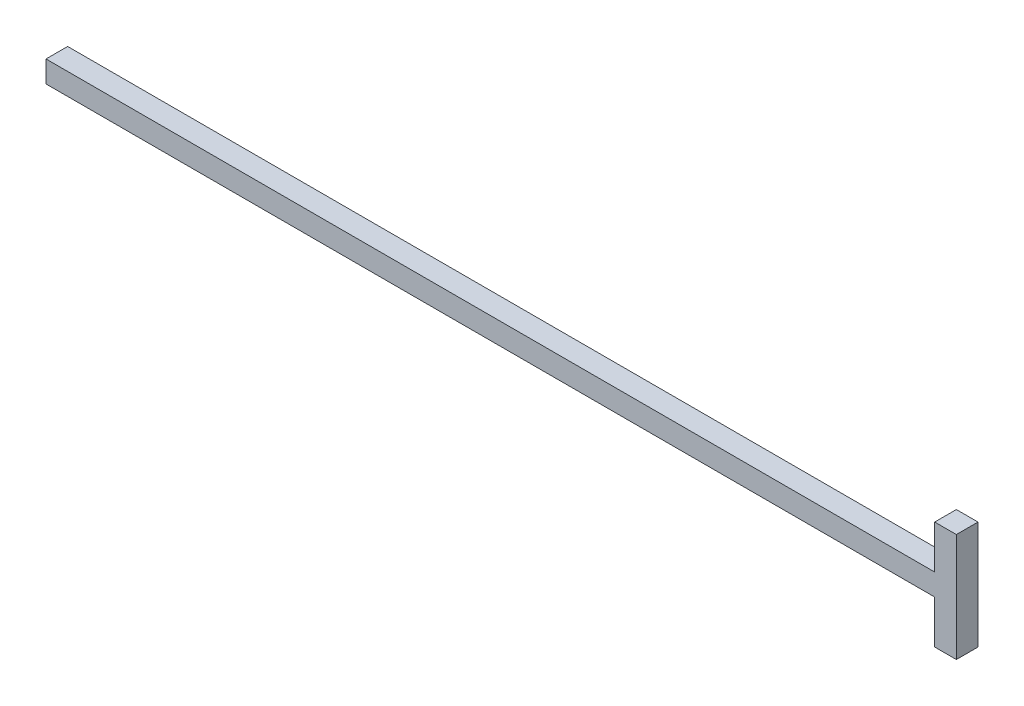
ISO-10303-21;
HEADER;
FILE_DESCRIPTION(('STEP AP214'),'2;1');
FILE_NAME('part.step','',(''),(''),'','','');
FILE_SCHEMA(('AUTOMOTIVE_DESIGN { 1 0 10303 214 1 1 1 1 }'));
ENDSEC;
DATA;
#1=APPLICATION_CONTEXT('core data for automotive mechanical design processes');
#2=APPLICATION_PROTOCOL_DEFINITION('international standard','automotive_design',2000,#1);
#3=PRODUCT_CONTEXT('',#1,'mechanical');
#4=PRODUCT('Part','Part','',(#3));
#5=PRODUCT_RELATED_PRODUCT_CATEGORY('part','',(#4));
#6=PRODUCT_DEFINITION_FORMATION('','',#4);
#7=PRODUCT_DEFINITION_CONTEXT('part definition',#1,'design');
#8=PRODUCT_DEFINITION('design','',#6,#7);
#9=PRODUCT_DEFINITION_SHAPE('','',#8);
#10=(LENGTH_UNIT() NAMED_UNIT(*) SI_UNIT(.MILLI.,.METRE.));
#11=(NAMED_UNIT(*) PLANE_ANGLE_UNIT() SI_UNIT($,.RADIAN.));
#12=(NAMED_UNIT(*) SI_UNIT($,.STERADIAN.) SOLID_ANGLE_UNIT());
#13=UNCERTAINTY_MEASURE_WITH_UNIT(LENGTH_MEASURE(1.E-05),#10,'distance_accuracy_value','');
#14=(GEOMETRIC_REPRESENTATION_CONTEXT(3) GLOBAL_UNCERTAINTY_ASSIGNED_CONTEXT((#13)) GLOBAL_UNIT_ASSIGNED_CONTEXT((#10,
#11,#12)) REPRESENTATION_CONTEXT('',''));
#15=CARTESIAN_POINT('',(0.,0.,0.));
#16=DIRECTION('',(0.,0.,1.));
#17=DIRECTION('',(1.,0.,0.));
#18=AXIS2_PLACEMENT_3D('',#15,#16,#17);
#19=CARTESIAN_POINT('',(133.477,0.,6.35));
#20=DIRECTION('',(1.,0.,0.));
#21=DIRECTION('',(0.,0.,-1.));
#22=AXIS2_PLACEMENT_3D('',#19,#20,#21);
#23=PLANE('',#22);
#24=DIRECTION('',(0.,-1.,0.));
#25=VECTOR('',#24,1.);
#26=CARTESIAN_POINT('',(133.477,0.,0.));
#27=LINE('',#26,#25);
#28=CARTESIAN_POINT('',(133.477,15.875,0.));
#29=VERTEX_POINT('',#28);
#30=CARTESIAN_POINT('',(133.477,-15.875,0.));
#31=VERTEX_POINT('',#30);
#32=EDGE_CURVE('E130',#29,#31,#27,.T.);
#33=ORIENTED_EDGE('',*,*,#32,.F.);
#34=DIRECTION('',(0.,0.,-1.));
#35=VECTOR('',#34,1.);
#36=CARTESIAN_POINT('',(133.477,15.875,6.35));
#37=LINE('',#36,#35);
#38=CARTESIAN_POINT('',(133.477,15.875,6.35));
#39=VERTEX_POINT('',#38);
#40=EDGE_CURVE('E11',#39,#29,#37,.T.);
#41=ORIENTED_EDGE('',*,*,#40,.F.);
#42=DIRECTION('',(0.,-1.,0.));
#43=VECTOR('',#42,1.);
#44=CARTESIAN_POINT('',(133.477,0.,6.35));
#45=LINE('',#44,#43);
#46=CARTESIAN_POINT('',(133.477,-15.875,6.35));
#47=VERTEX_POINT('',#46);
#48=EDGE_CURVE('E149',#39,#47,#45,.T.);
#49=ORIENTED_EDGE('',*,*,#48,.T.);
#50=DIRECTION('',(0.,0.,-1.));
#51=VECTOR('',#50,1.);
#52=CARTESIAN_POINT('',(133.477,-15.875,6.35));
#53=LINE('',#52,#51);
#54=EDGE_CURVE('E51',#47,#31,#53,.T.);
#55=ORIENTED_EDGE('',*,*,#54,.T.);
#56=EDGE_LOOP('',(#33,#41,#49,#55));
#57=FACE_BOUND('',#56,.T.);
#58=ADVANCED_FACE('F35',(#57),#23,.T.);
#59=CARTESIAN_POINT('',(0.,15.8750000000001,6.35));
#60=DIRECTION('',(0.,-1.,0.));
#61=DIRECTION('',(1.,0.,0.));
#62=AXIS2_PLACEMENT_3D('',#59,#60,#61);
#63=PLANE('',#62);
#64=DIRECTION('',(-1.,0.,0.));
#65=VECTOR('',#64,1.);
#66=CARTESIAN_POINT('',(0.,15.8750000000001,0.));
#67=LINE('',#66,#65);
#68=CARTESIAN_POINT('',(127.127,15.875,0.));
#69=VERTEX_POINT('',#68);
#70=EDGE_CURVE('E132',#29,#69,#67,.T.);
#71=ORIENTED_EDGE('',*,*,#70,.T.);
#72=DIRECTION('',(0.,0.,-1.));
#73=VECTOR('',#72,1.);
#74=CARTESIAN_POINT('',(127.127,15.875,6.35));
#75=LINE('',#74,#73);
#76=CARTESIAN_POINT('',(127.127,15.875,6.35));
#77=VERTEX_POINT('',#76);
#78=EDGE_CURVE('E43',#77,#69,#75,.T.);
#79=ORIENTED_EDGE('',*,*,#78,.F.);
#80=DIRECTION('',(-1.,0.,0.));
#81=VECTOR('',#80,1.);
#82=CARTESIAN_POINT('',(0.,15.8750000000001,6.35));
#83=LINE('',#82,#81);
#84=EDGE_CURVE('E174',#39,#77,#83,.T.);
#85=ORIENTED_EDGE('',*,*,#84,.F.);
#86=ORIENTED_EDGE('',*,*,#40,.T.);
#87=EDGE_LOOP('',(#71,#79,#85,#86));
#88=FACE_BOUND('',#87,.T.);
#89=ADVANCED_FACE('F165',(#88),#63,.F.);
#90=CARTESIAN_POINT('',(127.127,0.,6.35));
#91=DIRECTION('',(-1.,0.,0.));
#92=DIRECTION('',(0.,0.,1.));
#93=AXIS2_PLACEMENT_3D('',#90,#91,#92);
#94=PLANE('',#93);
#95=DIRECTION('',(0.,1.,0.));
#96=VECTOR('',#95,1.);
#97=CARTESIAN_POINT('',(127.127,0.,0.));
#98=LINE('',#97,#96);
#99=CARTESIAN_POINT('',(127.127,3.175,0.));
#100=VERTEX_POINT('',#99);
#101=EDGE_CURVE('E135',#100,#69,#98,.T.);
#102=ORIENTED_EDGE('',*,*,#101,.F.);
#103=DIRECTION('',(0.,0.,-1.));
#104=VECTOR('',#103,1.);
#105=CARTESIAN_POINT('',(127.127,3.175,6.35));
#106=LINE('',#105,#104);
#107=CARTESIAN_POINT('',(127.127,3.175,6.35));
#108=VERTEX_POINT('',#107);
#109=EDGE_CURVE('E155',#108,#100,#106,.T.);
#110=ORIENTED_EDGE('',*,*,#109,.F.);
#111=DIRECTION('',(0.,1.,0.));
#112=VECTOR('',#111,1.);
#113=CARTESIAN_POINT('',(127.127,0.,6.35));
#114=LINE('',#113,#112);
#115=EDGE_CURVE('E162',#108,#77,#114,.T.);
#116=ORIENTED_EDGE('',*,*,#115,.T.);
#117=ORIENTED_EDGE('',*,*,#78,.T.);
#118=EDGE_LOOP('',(#102,#110,#116,#117));
#119=FACE_BOUND('',#118,.T.);
#120=ADVANCED_FACE('F160',(#119),#94,.T.);
#121=CARTESIAN_POINT('',(0.,3.175,6.35));
#122=DIRECTION('',(0.,1.,0.));
#123=DIRECTION('',(0.,0.,1.));
#124=AXIS2_PLACEMENT_3D('',#121,#122,#123);
#125=PLANE('',#124);
#126=DIRECTION('',(1.,0.,0.));
#127=VECTOR('',#126,1.);
#128=CARTESIAN_POINT('',(0.,3.175,0.));
#129=LINE('',#128,#127);
#130=CARTESIAN_POINT('',(-133.477,3.175,0.));
#131=VERTEX_POINT('',#130);
#132=EDGE_CURVE('E138',#131,#100,#129,.T.);
#133=ORIENTED_EDGE('',*,*,#132,.F.);
#134=DIRECTION('',(0.,0.,-1.));
#135=VECTOR('',#134,1.);
#136=CARTESIAN_POINT('',(-133.477,3.175,6.35));
#137=LINE('',#136,#135);
#138=CARTESIAN_POINT('',(-133.477,3.175,6.35));
#139=VERTEX_POINT('',#138);
#140=EDGE_CURVE('E153',#139,#131,#137,.T.);
#141=ORIENTED_EDGE('',*,*,#140,.F.);
#142=DIRECTION('',(1.,0.,0.));
#143=VECTOR('',#142,1.);
#144=CARTESIAN_POINT('',(0.,3.175,6.35));
#145=LINE('',#144,#143);
#146=EDGE_CURVE('E173',#139,#108,#145,.T.);
#147=ORIENTED_EDGE('',*,*,#146,.T.);
#148=ORIENTED_EDGE('',*,*,#109,.T.);
#149=EDGE_LOOP('',(#133,#141,#147,#148));
#150=FACE_BOUND('',#149,.T.);
#151=ADVANCED_FACE('F171',(#150),#125,.T.);
#152=CARTESIAN_POINT('',(-133.477,0.,6.35));
#153=DIRECTION('',(1.,0.,0.));
#154=DIRECTION('',(0.,0.,-1.));
#155=AXIS2_PLACEMENT_3D('',#152,#153,#154);
#156=PLANE('',#155);
#157=DIRECTION('',(0.,-1.,0.));
#158=VECTOR('',#157,1.);
#159=CARTESIAN_POINT('',(-133.477,0.,0.));
#160=LINE('',#159,#158);
#161=CARTESIAN_POINT('',(-133.477,-3.175,0.));
#162=VERTEX_POINT('',#161);
#163=EDGE_CURVE('E141',#131,#162,#160,.T.);
#164=ORIENTED_EDGE('',*,*,#163,.T.);
#165=DIRECTION('',(0.,0.,-1.));
#166=VECTOR('',#165,1.);
#167=CARTESIAN_POINT('',(-133.477,-3.175,6.35));
#168=LINE('',#167,#166);
#169=CARTESIAN_POINT('',(-133.477,-3.175,6.35));
#170=VERTEX_POINT('',#169);
#171=EDGE_CURVE('E122',#170,#162,#168,.T.);
#172=ORIENTED_EDGE('',*,*,#171,.F.);
#173=DIRECTION('',(0.,-1.,0.));
#174=VECTOR('',#173,1.);
#175=CARTESIAN_POINT('',(-133.477,0.,6.35));
#176=LINE('',#175,#174);
#177=EDGE_CURVE('E110',#139,#170,#176,.T.);
#178=ORIENTED_EDGE('',*,*,#177,.F.);
#179=ORIENTED_EDGE('',*,*,#140,.T.);
#180=EDGE_LOOP('',(#164,#172,#178,#179));
#181=FACE_BOUND('',#180,.T.);
#182=ADVANCED_FACE('F200',(#181),#156,.F.);
#183=CARTESIAN_POINT('',(0.,-3.17499999999998,6.35));
#184=DIRECTION('',(0.,1.,0.));
#185=DIRECTION('',(-1.,0.,0.));
#186=AXIS2_PLACEMENT_3D('',#183,#184,#185);
#187=PLANE('',#186);
#188=DIRECTION('',(1.,0.,0.));
#189=VECTOR('',#188,1.);
#190=CARTESIAN_POINT('',(0.,-3.17499999999998,0.));
#191=LINE('',#190,#189);
#192=CARTESIAN_POINT('',(127.127,-3.17499999999995,0.));
#193=VERTEX_POINT('',#192);
#194=EDGE_CURVE('E119',#162,#193,#191,.T.);
#195=ORIENTED_EDGE('',*,*,#194,.T.);
#196=DIRECTION('',(0.,0.,-1.));
#197=VECTOR('',#196,1.);
#198=CARTESIAN_POINT('',(127.127,-3.17499999999995,6.35));
#199=LINE('',#198,#197);
#200=CARTESIAN_POINT('',(127.127,-3.17499999999995,6.35));
#201=VERTEX_POINT('',#200);
#202=EDGE_CURVE('E116',#201,#193,#199,.T.);
#203=ORIENTED_EDGE('',*,*,#202,.F.);
#204=DIRECTION('',(1.,0.,0.));
#205=VECTOR('',#204,1.);
#206=CARTESIAN_POINT('',(0.,-3.17499999999998,6.35));
#207=LINE('',#206,#205);
#208=EDGE_CURVE('E101',#170,#201,#207,.T.);
#209=ORIENTED_EDGE('',*,*,#208,.F.);
#210=ORIENTED_EDGE('',*,*,#171,.T.);
#211=EDGE_LOOP('',(#195,#203,#209,#210));
#212=FACE_BOUND('',#211,.T.);
#213=ADVANCED_FACE('F117',(#212),#187,.F.);
#214=CARTESIAN_POINT('',(127.127,0.,6.35));
#215=DIRECTION('',(1.,0.,0.));
#216=DIRECTION('',(0.,0.,-1.));
#217=AXIS2_PLACEMENT_3D('',#214,#215,#216);
#218=PLANE('',#217);
#219=DIRECTION('',(0.,-1.,0.));
#220=VECTOR('',#219,1.);
#221=CARTESIAN_POINT('',(127.127,0.,0.));
#222=LINE('',#221,#220);
#223=CARTESIAN_POINT('',(127.127,-15.875,0.));
#224=VERTEX_POINT('',#223);
#225=EDGE_CURVE('E144',#193,#224,#222,.T.);
#226=ORIENTED_EDGE('',*,*,#225,.T.);
#227=DIRECTION('',(0.,0.,-1.));
#228=VECTOR('',#227,1.);
#229=CARTESIAN_POINT('',(127.127,-15.875,6.35));
#230=LINE('',#229,#228);
#231=CARTESIAN_POINT('',(127.127,-15.875,6.35));
#232=VERTEX_POINT('',#231);
#233=EDGE_CURVE('E77',#232,#224,#230,.T.);
#234=ORIENTED_EDGE('',*,*,#233,.F.);
#235=DIRECTION('',(0.,-1.,0.));
#236=VECTOR('',#235,1.);
#237=CARTESIAN_POINT('',(127.127,0.,6.35));
#238=LINE('',#237,#236);
#239=EDGE_CURVE('E107',#201,#232,#238,.T.);
#240=ORIENTED_EDGE('',*,*,#239,.F.);
#241=ORIENTED_EDGE('',*,*,#202,.T.);
#242=EDGE_LOOP('',(#226,#234,#240,#241));
#243=FACE_BOUND('',#242,.T.);
#244=ADVANCED_FACE('F124',(#243),#218,.F.);
#245=CARTESIAN_POINT('',(0.,-15.875,6.35));
#246=DIRECTION('',(0.,-1.,0.));
#247=DIRECTION('',(0.,0.,-1.));
#248=AXIS2_PLACEMENT_3D('',#245,#246,#247);
#249=PLANE('',#248);
#250=DIRECTION('',(-1.,0.,0.));
#251=VECTOR('',#250,1.);
#252=CARTESIAN_POINT('',(0.,-15.875,0.));
#253=LINE('',#252,#251);
#254=EDGE_CURVE('E146',#31,#224,#253,.T.);
#255=ORIENTED_EDGE('',*,*,#254,.F.);
#256=ORIENTED_EDGE('',*,*,#54,.F.);
#257=DIRECTION('',(-1.,0.,0.));
#258=VECTOR('',#257,1.);
#259=CARTESIAN_POINT('',(0.,-15.875,6.35));
#260=LINE('',#259,#258);
#261=EDGE_CURVE('E125',#47,#232,#260,.T.);
#262=ORIENTED_EDGE('',*,*,#261,.T.);
#263=ORIENTED_EDGE('',*,*,#233,.T.);
#264=EDGE_LOOP('',(#255,#256,#262,#263));
#265=FACE_BOUND('',#264,.T.);
#266=ADVANCED_FACE('F179',(#265),#249,.T.);
#267=CARTESIAN_POINT('',(0.,0.,6.35));
#268=DIRECTION('',(0.,0.,1.));
#269=DIRECTION('',(1.,0.,0.));
#270=AXIS2_PLACEMENT_3D('',#267,#268,#269);
#271=PLANE('',#270);
#272=ORIENTED_EDGE('',*,*,#48,.F.);
#273=ORIENTED_EDGE('',*,*,#84,.T.);
#274=ORIENTED_EDGE('',*,*,#115,.F.);
#275=ORIENTED_EDGE('',*,*,#146,.F.);
#276=ORIENTED_EDGE('',*,*,#177,.T.);
#277=ORIENTED_EDGE('',*,*,#208,.T.);
#278=ORIENTED_EDGE('',*,*,#239,.T.);
#279=ORIENTED_EDGE('',*,*,#261,.F.);
#280=EDGE_LOOP('',(#272,#273,#274,#275,#276,#277,#278,#279));
#281=FACE_BOUND('',#280,.T.);
#282=ADVANCED_FACE('F104',(#281),#271,.T.);
#283=CARTESIAN_POINT('',(0.,0.,0.));
#284=DIRECTION('',(0.,0.,1.));
#285=DIRECTION('',(1.,0.,0.));
#286=AXIS2_PLACEMENT_3D('',#283,#284,#285);
#287=PLANE('',#286);
#288=ORIENTED_EDGE('',*,*,#32,.T.);
#289=ORIENTED_EDGE('',*,*,#254,.T.);
#290=ORIENTED_EDGE('',*,*,#225,.F.);
#291=ORIENTED_EDGE('',*,*,#194,.F.);
#292=ORIENTED_EDGE('',*,*,#163,.F.);
#293=ORIENTED_EDGE('',*,*,#132,.T.);
#294=ORIENTED_EDGE('',*,*,#101,.T.);
#295=ORIENTED_EDGE('',*,*,#70,.F.);
#296=EDGE_LOOP('',(#288,#289,#290,#291,#292,#293,#294,#295));
#297=FACE_BOUND('',#296,.T.);
#298=ADVANCED_FACE('F167',(#297),#287,.F.);
#299=CLOSED_SHELL('',(#58,#89,#120,#151,#182,#213,#244,#266,#282,#298));
#300=MANIFOLD_SOLID_BREP('B2',#299);
#301=ADVANCED_BREP_SHAPE_REPRESENTATION('',(#18,#300),#14);
#302=SHAPE_DEFINITION_REPRESENTATION(#9,#301);
ENDSEC;
END-ISO-10303-21;
